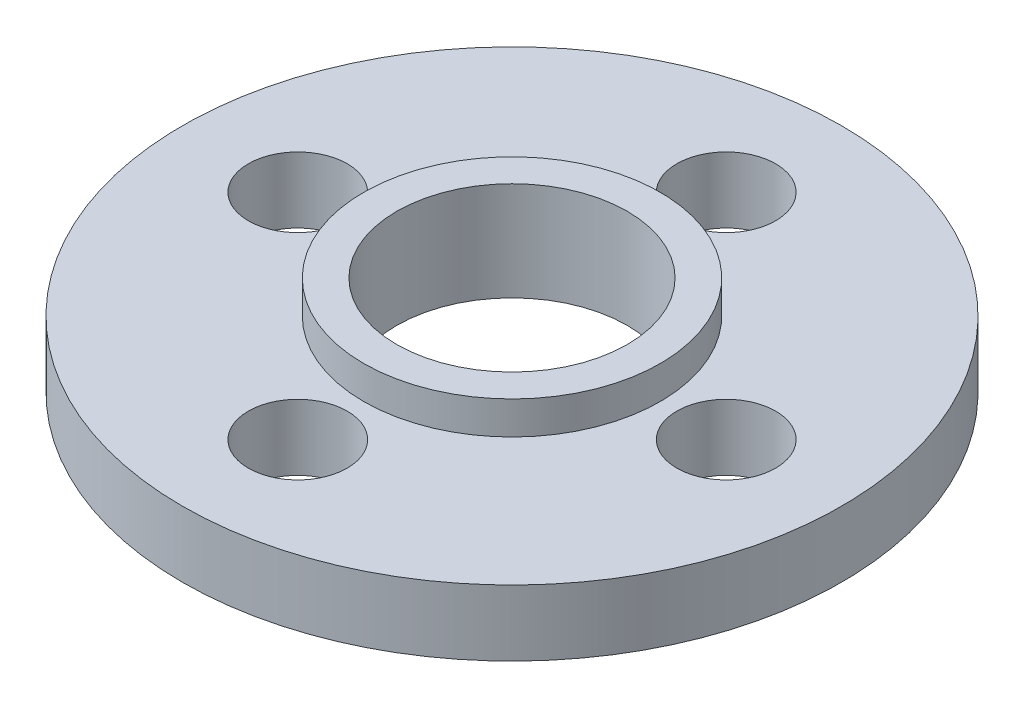
ISO-10303-21;
HEADER;
FILE_DESCRIPTION(('STEP AP214'),'2;1');
FILE_NAME('part.step','',(''),(''),'','','');
FILE_SCHEMA(('AUTOMOTIVE_DESIGN { 1 0 10303 214 1 1 1 1 }'));
ENDSEC;
DATA;
#1=APPLICATION_CONTEXT('core data for automotive mechanical design processes');
#2=APPLICATION_PROTOCOL_DEFINITION('international standard','automotive_design',2000,#1);
#3=PRODUCT_CONTEXT('',#1,'mechanical');
#4=PRODUCT('Part','Part','',(#3));
#5=PRODUCT_RELATED_PRODUCT_CATEGORY('part','',(#4));
#6=PRODUCT_DEFINITION_FORMATION('','',#4);
#7=PRODUCT_DEFINITION_CONTEXT('part definition',#1,'design');
#8=PRODUCT_DEFINITION('design','',#6,#7);
#9=PRODUCT_DEFINITION_SHAPE('','',#8);
#10=(LENGTH_UNIT() NAMED_UNIT(*) SI_UNIT(.MILLI.,.METRE.));
#11=(NAMED_UNIT(*) PLANE_ANGLE_UNIT() SI_UNIT($,.RADIAN.));
#12=(NAMED_UNIT(*) SI_UNIT($,.STERADIAN.) SOLID_ANGLE_UNIT());
#13=UNCERTAINTY_MEASURE_WITH_UNIT(LENGTH_MEASURE(1.E-05),#10,'distance_accuracy_value','');
#14=(GEOMETRIC_REPRESENTATION_CONTEXT(3) GLOBAL_UNCERTAINTY_ASSIGNED_CONTEXT((#13)) GLOBAL_UNIT_ASSIGNED_CONTEXT((#10,
#11,#12)) REPRESENTATION_CONTEXT('',''));
#15=CARTESIAN_POINT('',(0.,0.,0.));
#16=DIRECTION('',(0.,0.,1.));
#17=DIRECTION('',(1.,0.,0.));
#18=AXIS2_PLACEMENT_3D('',#15,#16,#17);
#19=CARTESIAN_POINT('',(0.,3.,0.));
#20=DIRECTION('',(0.,1.,0.));
#21=DIRECTION('',(0.,0.,1.));
#22=AXIS2_PLACEMENT_3D('',#19,#20,#21);
#23=PLANE('',#22);
#24=CARTESIAN_POINT('',(0.,3.,0.));
#25=DIRECTION('',(0.,1.,0.));
#26=DIRECTION('',(0.,0.,1.));
#27=AXIS2_PLACEMENT_3D('',#24,#25,#26);
#28=CIRCLE('',#27,3.5);
#29=CARTESIAN_POINT('',(0.,3.,3.5));
#30=VERTEX_POINT('',#29);
#31=EDGE_CURVE('E39',#30,#30,#28,.T.);
#32=ORIENTED_EDGE('',*,*,#31,.F.);
#33=EDGE_LOOP('',(#32));
#34=FACE_BOUND('',#33,.T.);
#35=CARTESIAN_POINT('',(0.,3.,0.));
#36=DIRECTION('',(0.,1.,0.));
#37=DIRECTION('',(0.,0.,1.));
#38=AXIS2_PLACEMENT_3D('',#35,#36,#37);
#39=CIRCLE('',#38,4.5);
#40=CARTESIAN_POINT('',(0.,3.,4.5));
#41=VERTEX_POINT('',#40);
#42=EDGE_CURVE('E65',#41,#41,#39,.T.);
#43=ORIENTED_EDGE('',*,*,#42,.T.);
#44=EDGE_LOOP('',(#43));
#45=FACE_BOUND('',#44,.T.);
#46=ADVANCED_FACE('F32',(#34,#45),#23,.T.);
#47=CARTESIAN_POINT('',(0.,3.,0.));
#48=DIRECTION('',(0.,-1.,0.));
#49=DIRECTION('',(0.,0.,-1.));
#50=AXIS2_PLACEMENT_3D('',#47,#48,#49);
#51=CYLINDRICAL_SURFACE('',#50,10.);
#52=CARTESIAN_POINT('',(0.,0.,0.));
#53=DIRECTION('',(0.,1.,0.));
#54=DIRECTION('',(0.,0.,1.));
#55=AXIS2_PLACEMENT_3D('',#52,#53,#54);
#56=CIRCLE('',#55,10.);
#57=CARTESIAN_POINT('',(0.,0.,10.));
#58=VERTEX_POINT('',#57);
#59=EDGE_CURVE('E10',#58,#58,#56,.T.);
#60=ORIENTED_EDGE('',*,*,#59,.T.);
#61=EDGE_LOOP('',(#60));
#62=FACE_BOUND('',#61,.T.);
#63=CARTESIAN_POINT('',(0.,2.,0.));
#64=DIRECTION('',(0.,1.,0.));
#65=DIRECTION('',(0.,0.,1.));
#66=AXIS2_PLACEMENT_3D('',#63,#64,#65);
#67=CIRCLE('',#66,10.);
#68=CARTESIAN_POINT('',(0.,2.,10.));
#69=VERTEX_POINT('',#68);
#70=EDGE_CURVE('E61',#69,#69,#67,.T.);
#71=ORIENTED_EDGE('',*,*,#70,.F.);
#72=EDGE_LOOP('',(#71));
#73=FACE_BOUND('',#72,.T.);
#74=ADVANCED_FACE('F34',(#62,#73),#51,.T.);
#75=CARTESIAN_POINT('',(0.,3.,-6.5));
#76=DIRECTION('',(0.,-1.,0.));
#77=DIRECTION('',(0.,0.,-1.));
#78=AXIS2_PLACEMENT_3D('',#75,#76,#77);
#79=CYLINDRICAL_SURFACE('',#78,1.5);
#80=CARTESIAN_POINT('',(0.,0.,-6.5));
#81=DIRECTION('',(0.,1.,0.));
#82=DIRECTION('',(0.,0.,1.));
#83=AXIS2_PLACEMENT_3D('',#80,#81,#82);
#84=CIRCLE('',#83,1.5);
#85=CARTESIAN_POINT('',(0.,0.,-5.));
#86=VERTEX_POINT('',#85);
#87=EDGE_CURVE('E48',#86,#86,#84,.T.);
#88=ORIENTED_EDGE('',*,*,#87,.F.);
#89=EDGE_LOOP('',(#88));
#90=FACE_BOUND('',#89,.T.);
#91=CARTESIAN_POINT('',(0.,2.,-6.5));
#92=DIRECTION('',(0.,1.,0.));
#93=DIRECTION('',(0.,0.,1.));
#94=AXIS2_PLACEMENT_3D('',#91,#92,#93);
#95=CIRCLE('',#94,1.5);
#96=CARTESIAN_POINT('',(0.,2.,-5.));
#97=VERTEX_POINT('',#96);
#98=EDGE_CURVE('E73',#97,#97,#95,.T.);
#99=ORIENTED_EDGE('',*,*,#98,.T.);
#100=EDGE_LOOP('',(#99));
#101=FACE_BOUND('',#100,.T.);
#102=ADVANCED_FACE('F102',(#90,#101),#79,.F.);
#103=CARTESIAN_POINT('',(0.,3.,6.5));
#104=DIRECTION('',(0.,-1.,0.));
#105=DIRECTION('',(0.,0.,-1.));
#106=AXIS2_PLACEMENT_3D('',#103,#104,#105);
#107=CYLINDRICAL_SURFACE('',#106,1.5);
#108=CARTESIAN_POINT('',(0.,0.,6.5));
#109=DIRECTION('',(0.,1.,0.));
#110=DIRECTION('',(0.,0.,-1.));
#111=AXIS2_PLACEMENT_3D('',#108,#109,#110);
#112=CIRCLE('',#111,1.5);
#113=CARTESIAN_POINT('',(0.,0.,5.));
#114=VERTEX_POINT('',#113);
#115=EDGE_CURVE('E52',#114,#114,#112,.T.);
#116=ORIENTED_EDGE('',*,*,#115,.F.);
#117=EDGE_LOOP('',(#116));
#118=FACE_BOUND('',#117,.T.);
#119=CARTESIAN_POINT('',(0.,2.,6.5));
#120=DIRECTION('',(0.,1.,0.));
#121=DIRECTION('',(0.,0.,1.));
#122=AXIS2_PLACEMENT_3D('',#119,#120,#121);
#123=CIRCLE('',#122,1.5);
#124=CARTESIAN_POINT('',(0.,2.,8.));
#125=VERTEX_POINT('',#124);
#126=EDGE_CURVE('E68',#125,#125,#123,.T.);
#127=ORIENTED_EDGE('',*,*,#126,.T.);
#128=EDGE_LOOP('',(#127));
#129=FACE_BOUND('',#128,.T.);
#130=ADVANCED_FACE('F107',(#118,#129),#107,.F.);
#131=CARTESIAN_POINT('',(6.5,3.,0.));
#132=DIRECTION('',(0.,-1.,0.));
#133=DIRECTION('',(0.,0.,-1.));
#134=AXIS2_PLACEMENT_3D('',#131,#132,#133);
#135=CYLINDRICAL_SURFACE('',#134,1.5);
#136=CARTESIAN_POINT('',(6.5,0.,0.));
#137=DIRECTION('',(0.,1.,0.));
#138=DIRECTION('',(0.,0.,1.));
#139=AXIS2_PLACEMENT_3D('',#136,#137,#138);
#140=CIRCLE('',#139,1.5);
#141=CARTESIAN_POINT('',(6.5,0.,1.5));
#142=VERTEX_POINT('',#141);
#143=EDGE_CURVE('E55',#142,#142,#140,.T.);
#144=ORIENTED_EDGE('',*,*,#143,.F.);
#145=EDGE_LOOP('',(#144));
#146=FACE_BOUND('',#145,.T.);
#147=CARTESIAN_POINT('',(6.5,2.,0.));
#148=DIRECTION('',(0.,1.,0.));
#149=DIRECTION('',(0.,0.,1.));
#150=AXIS2_PLACEMENT_3D('',#147,#148,#149);
#151=CIRCLE('',#150,1.5);
#152=CARTESIAN_POINT('',(6.5,2.,1.5));
#153=VERTEX_POINT('',#152);
#154=EDGE_CURVE('E76',#153,#153,#151,.T.);
#155=ORIENTED_EDGE('',*,*,#154,.T.);
#156=EDGE_LOOP('',(#155));
#157=FACE_BOUND('',#156,.T.);
#158=ADVANCED_FACE('F123',(#146,#157),#135,.F.);
#159=CARTESIAN_POINT('',(-6.5,3.,0.));
#160=DIRECTION('',(0.,-1.,0.));
#161=DIRECTION('',(0.,0.,-1.));
#162=AXIS2_PLACEMENT_3D('',#159,#160,#161);
#163=CYLINDRICAL_SURFACE('',#162,1.5);
#164=CARTESIAN_POINT('',(-6.5,0.,0.));
#165=DIRECTION('',(0.,1.,0.));
#166=DIRECTION('',(0.,0.,-1.));
#167=AXIS2_PLACEMENT_3D('',#164,#165,#166);
#168=CIRCLE('',#167,1.5);
#169=CARTESIAN_POINT('',(-6.5,0.,-1.5));
#170=VERTEX_POINT('',#169);
#171=EDGE_CURVE('E58',#170,#170,#168,.T.);
#172=ORIENTED_EDGE('',*,*,#171,.F.);
#173=EDGE_LOOP('',(#172));
#174=FACE_BOUND('',#173,.T.);
#175=CARTESIAN_POINT('',(-6.5,2.,0.));
#176=DIRECTION('',(0.,1.,0.));
#177=DIRECTION('',(0.,0.,1.));
#178=AXIS2_PLACEMENT_3D('',#175,#176,#177);
#179=CIRCLE('',#178,1.5);
#180=CARTESIAN_POINT('',(-6.5,2.,1.5));
#181=VERTEX_POINT('',#180);
#182=EDGE_CURVE('E79',#181,#181,#179,.T.);
#183=ORIENTED_EDGE('',*,*,#182,.T.);
#184=EDGE_LOOP('',(#183));
#185=FACE_BOUND('',#184,.T.);
#186=ADVANCED_FACE('F83',(#174,#185),#163,.F.);
#187=CARTESIAN_POINT('',(0.,0.,0.));
#188=DIRECTION('',(0.,1.,0.));
#189=DIRECTION('',(0.,0.,1.));
#190=AXIS2_PLACEMENT_3D('',#187,#188,#189);
#191=PLANE('',#190);
#192=ORIENTED_EDGE('',*,*,#143,.T.);
#193=EDGE_LOOP('',(#192));
#194=FACE_BOUND('',#193,.T.);
#195=ORIENTED_EDGE('',*,*,#87,.T.);
#196=EDGE_LOOP('',(#195));
#197=FACE_BOUND('',#196,.T.);
#198=ORIENTED_EDGE('',*,*,#59,.F.);
#199=EDGE_LOOP('',(#198));
#200=FACE_BOUND('',#199,.T.);
#201=CARTESIAN_POINT('',(0.,0.,0.));
#202=DIRECTION('',(0.,1.,0.));
#203=DIRECTION('',(0.,0.,1.));
#204=AXIS2_PLACEMENT_3D('',#201,#202,#203);
#205=CIRCLE('',#204,3.5);
#206=CARTESIAN_POINT('',(0.,0.,3.5));
#207=VERTEX_POINT('',#206);
#208=EDGE_CURVE('E43',#207,#207,#205,.T.);
#209=ORIENTED_EDGE('',*,*,#208,.T.);
#210=EDGE_LOOP('',(#209));
#211=FACE_BOUND('',#210,.T.);
#212=ORIENTED_EDGE('',*,*,#115,.T.);
#213=EDGE_LOOP('',(#212));
#214=FACE_BOUND('',#213,.T.);
#215=ORIENTED_EDGE('',*,*,#171,.T.);
#216=EDGE_LOOP('',(#215));
#217=FACE_BOUND('',#216,.T.);
#218=ADVANCED_FACE('F116',(#194,#197,#200,#211,#214,#217),#191,.F.);
#219=CARTESIAN_POINT('',(0.,3.,0.));
#220=DIRECTION('',(0.,-1.,0.));
#221=DIRECTION('',(0.,0.,-1.));
#222=AXIS2_PLACEMENT_3D('',#219,#220,#221);
#223=CYLINDRICAL_SURFACE('',#222,3.5);
#224=ORIENTED_EDGE('',*,*,#31,.T.);
#225=EDGE_LOOP('',(#224));
#226=FACE_BOUND('',#225,.T.);
#227=ORIENTED_EDGE('',*,*,#208,.F.);
#228=EDGE_LOOP('',(#227));
#229=FACE_BOUND('',#228,.T.);
#230=ADVANCED_FACE('F89',(#226,#229),#223,.F.);
#231=CARTESIAN_POINT('',(0.,2.,0.));
#232=DIRECTION('',(0.,1.,0.));
#233=DIRECTION('',(0.,0.,1.));
#234=AXIS2_PLACEMENT_3D('',#231,#232,#233);
#235=PLANE('',#234);
#236=ORIENTED_EDGE('',*,*,#182,.F.);
#237=EDGE_LOOP('',(#236));
#238=FACE_BOUND('',#237,.T.);
#239=ORIENTED_EDGE('',*,*,#154,.F.);
#240=EDGE_LOOP('',(#239));
#241=FACE_BOUND('',#240,.T.);
#242=ORIENTED_EDGE('',*,*,#98,.F.);
#243=EDGE_LOOP('',(#242));
#244=FACE_BOUND('',#243,.T.);
#245=ORIENTED_EDGE('',*,*,#126,.F.);
#246=EDGE_LOOP('',(#245));
#247=FACE_BOUND('',#246,.T.);
#248=CARTESIAN_POINT('',(0.,2.,0.));
#249=DIRECTION('',(0.,1.,0.));
#250=DIRECTION('',(0.,0.,1.));
#251=AXIS2_PLACEMENT_3D('',#248,#249,#250);
#252=CIRCLE('',#251,4.5);
#253=CARTESIAN_POINT('',(0.,2.,4.5));
#254=VERTEX_POINT('',#253);
#255=EDGE_CURVE('E64',#254,#254,#252,.T.);
#256=ORIENTED_EDGE('',*,*,#255,.F.);
#257=EDGE_LOOP('',(#256));
#258=FACE_BOUND('',#257,.T.);
#259=ORIENTED_EDGE('',*,*,#70,.T.);
#260=EDGE_LOOP('',(#259));
#261=FACE_BOUND('',#260,.T.);
#262=ADVANCED_FACE('F85',(#238,#241,#244,#247,#258,#261),#235,.T.);
#263=CARTESIAN_POINT('',(0.,2.,0.));
#264=DIRECTION('',(0.,1.,0.));
#265=DIRECTION('',(0.,0.,1.));
#266=AXIS2_PLACEMENT_3D('',#263,#264,#265);
#267=CYLINDRICAL_SURFACE('',#266,4.5);
#268=ORIENTED_EDGE('',*,*,#255,.T.);
#269=EDGE_LOOP('',(#268));
#270=FACE_BOUND('',#269,.T.);
#271=ORIENTED_EDGE('',*,*,#42,.F.);
#272=EDGE_LOOP('',(#271));
#273=FACE_BOUND('',#272,.T.);
#274=ADVANCED_FACE('F88',(#270,#273),#267,.T.);
#275=CLOSED_SHELL('',(#46,#74,#102,#130,#158,#186,#218,#230,#262,#274));
#276=MANIFOLD_SOLID_BREP('B2',#275);
#277=ADVANCED_BREP_SHAPE_REPRESENTATION('',(#18,#276),#14);
#278=SHAPE_DEFINITION_REPRESENTATION(#9,#277);
ENDSEC;
END-ISO-10303-21;
